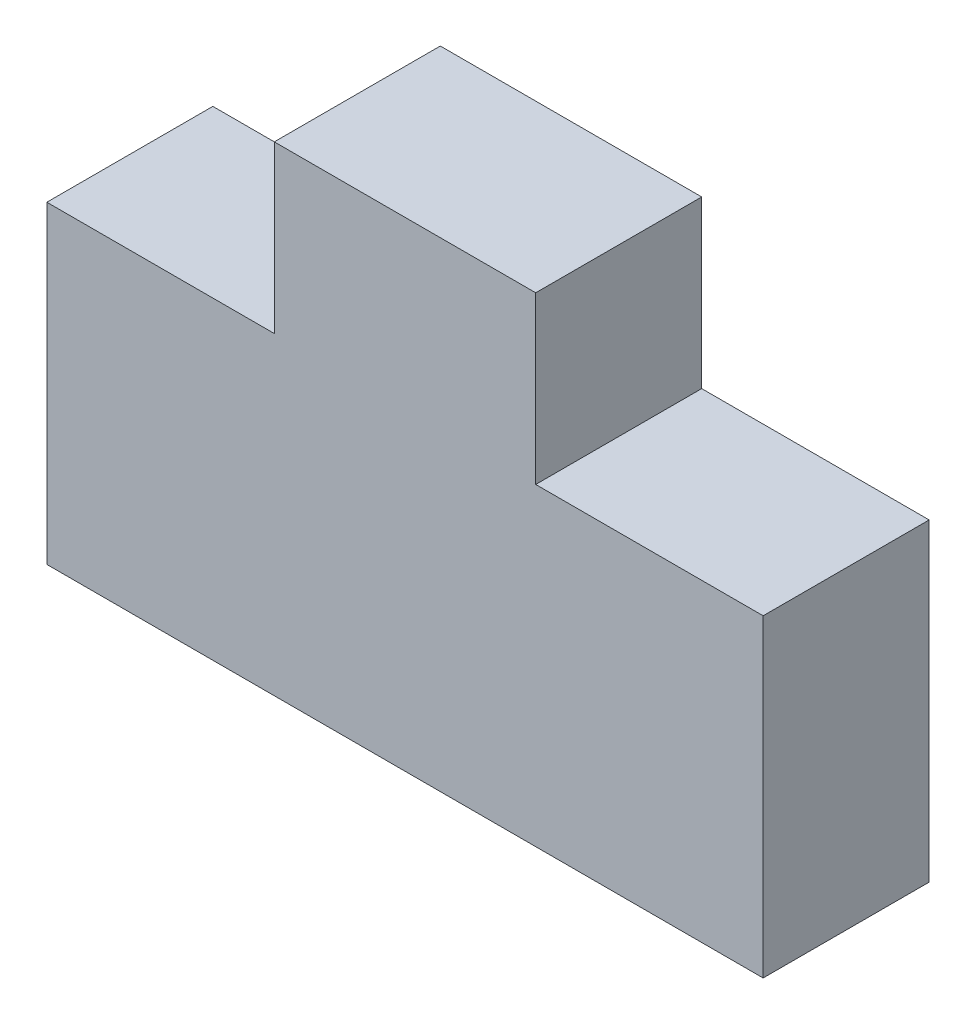
ISO-10303-21;
HEADER;
FILE_DESCRIPTION(('STEP AP214'),'2;1');
FILE_NAME('part.step','',(''),(''),'','','');
FILE_SCHEMA(('AUTOMOTIVE_DESIGN { 1 0 10303 214 1 1 1 1 }'));
ENDSEC;
DATA;
#1=APPLICATION_CONTEXT('core data for automotive mechanical design processes');
#2=APPLICATION_PROTOCOL_DEFINITION('international standard','automotive_design',2000,#1);
#3=PRODUCT_CONTEXT('',#1,'mechanical');
#4=PRODUCT('Part','Part','',(#3));
#5=PRODUCT_RELATED_PRODUCT_CATEGORY('part','',(#4));
#6=PRODUCT_DEFINITION_FORMATION('','',#4);
#7=PRODUCT_DEFINITION_CONTEXT('part definition',#1,'design');
#8=PRODUCT_DEFINITION('design','',#6,#7);
#9=PRODUCT_DEFINITION_SHAPE('','',#8);
#10=(LENGTH_UNIT() NAMED_UNIT(*) SI_UNIT(.MILLI.,.METRE.));
#11=(NAMED_UNIT(*) PLANE_ANGLE_UNIT() SI_UNIT($,.RADIAN.));
#12=(NAMED_UNIT(*) SI_UNIT($,.STERADIAN.) SOLID_ANGLE_UNIT());
#13=UNCERTAINTY_MEASURE_WITH_UNIT(LENGTH_MEASURE(1.E-05),#10,'distance_accuracy_value','');
#14=(GEOMETRIC_REPRESENTATION_CONTEXT(3) GLOBAL_UNCERTAINTY_ASSIGNED_CONTEXT((#13)) GLOBAL_UNIT_ASSIGNED_CONTEXT((#10,
#11,#12)) REPRESENTATION_CONTEXT('',''));
#15=CARTESIAN_POINT('',(0.,0.,0.));
#16=DIRECTION('',(0.,0.,1.));
#17=DIRECTION('',(1.,0.,0.));
#18=AXIS2_PLACEMENT_3D('',#15,#16,#17);
#19=CARTESIAN_POINT('',(0.,12.,0.));
#20=DIRECTION('',(0.,-1.,0.));
#21=DIRECTION('',(0.,0.,-1.));
#22=AXIS2_PLACEMENT_3D('',#19,#20,#21);
#23=PLANE('',#22);
#24=DIRECTION('',(0.,0.,1.));
#25=VECTOR('',#24,1.);
#26=CARTESIAN_POINT('',(8.7,12.,-6.35));
#27=LINE('',#26,#25);
#28=CARTESIAN_POINT('',(8.7,12.,-6.35));
#29=VERTEX_POINT('',#28);
#30=CARTESIAN_POINT('',(8.7,12.,0.));
#31=VERTEX_POINT('',#30);
#32=EDGE_CURVE('E111',#29,#31,#27,.T.);
#33=ORIENTED_EDGE('',*,*,#32,.F.);
#34=DIRECTION('',(-1.,0.,0.));
#35=VECTOR('',#34,1.);
#36=CARTESIAN_POINT('',(0.,12.,-6.35));
#37=LINE('',#36,#35);
#38=CARTESIAN_POINT('',(0.,12.,-6.35));
#39=VERTEX_POINT('',#38);
#40=EDGE_CURVE('E57',#29,#39,#37,.T.);
#41=ORIENTED_EDGE('',*,*,#40,.T.);
#42=DIRECTION('',(0.,0.,1.));
#43=VECTOR('',#42,1.);
#44=CARTESIAN_POINT('',(0.,12.,0.));
#45=LINE('',#44,#43);
#46=CARTESIAN_POINT('',(0.,12.,0.));
#47=VERTEX_POINT('',#46);
#48=EDGE_CURVE('E139',#39,#47,#45,.T.);
#49=ORIENTED_EDGE('',*,*,#48,.T.);
#50=DIRECTION('',(1.,0.,0.));
#51=VECTOR('',#50,1.);
#52=CARTESIAN_POINT('',(0.,12.,0.));
#53=LINE('',#52,#51);
#54=EDGE_CURVE('E86',#47,#31,#53,.T.);
#55=ORIENTED_EDGE('',*,*,#54,.T.);
#56=EDGE_LOOP('',(#33,#41,#49,#55));
#57=FACE_BOUND('',#56,.T.);
#58=ADVANCED_FACE('F33',(#57),#23,.F.);
#59=CARTESIAN_POINT('',(0.,12.,0.));
#60=DIRECTION('',(1.,0.,0.));
#61=DIRECTION('',(0.,0.,-1.));
#62=AXIS2_PLACEMENT_3D('',#59,#60,#61);
#63=PLANE('',#62);
#64=DIRECTION('',(0.,0.,1.));
#65=VECTOR('',#64,1.);
#66=CARTESIAN_POINT('',(0.,0.,0.));
#67=LINE('',#66,#65);
#68=CARTESIAN_POINT('',(0.,0.,-6.35));
#69=VERTEX_POINT('',#68);
#70=CARTESIAN_POINT('',(0.,0.,0.));
#71=VERTEX_POINT('',#70);
#72=EDGE_CURVE('E131',#69,#71,#67,.T.);
#73=ORIENTED_EDGE('',*,*,#72,.T.);
#74=DIRECTION('',(0.,-1.,0.));
#75=VECTOR('',#74,1.);
#76=CARTESIAN_POINT('',(0.,12.,0.));
#77=LINE('',#76,#75);
#78=EDGE_CURVE('E11',#47,#71,#77,.T.);
#79=ORIENTED_EDGE('',*,*,#78,.F.);
#80=ORIENTED_EDGE('',*,*,#48,.F.);
#81=DIRECTION('',(0.,-1.,0.));
#82=VECTOR('',#81,1.);
#83=CARTESIAN_POINT('',(0.,12.,-6.35));
#84=LINE('',#83,#82);
#85=EDGE_CURVE('E122',#39,#69,#84,.T.);
#86=ORIENTED_EDGE('',*,*,#85,.T.);
#87=EDGE_LOOP('',(#73,#79,#80,#86));
#88=FACE_BOUND('',#87,.T.);
#89=ADVANCED_FACE('F35',(#88),#63,.F.);
#90=CARTESIAN_POINT('',(0.,12.,0.));
#91=DIRECTION('',(0.,0.,-1.));
#92=DIRECTION('',(-1.,0.,0.));
#93=AXIS2_PLACEMENT_3D('',#90,#91,#92);
#94=PLANE('',#93);
#95=DIRECTION('',(1.,0.,0.));
#96=VECTOR('',#95,1.);
#97=CARTESIAN_POINT('',(0.,0.,0.));
#98=LINE('',#97,#96);
#99=CARTESIAN_POINT('',(27.4,0.,0.));
#100=VERTEX_POINT('',#99);
#101=EDGE_CURVE('E134',#71,#100,#98,.T.);
#102=ORIENTED_EDGE('',*,*,#101,.T.);
#103=DIRECTION('',(0.,-1.,0.));
#104=VECTOR('',#103,1.);
#105=CARTESIAN_POINT('',(27.4,12.,0.));
#106=LINE('',#105,#104);
#107=CARTESIAN_POINT('',(27.4,12.,0.));
#108=VERTEX_POINT('',#107);
#109=EDGE_CURVE('E41',#108,#100,#106,.T.);
#110=ORIENTED_EDGE('',*,*,#109,.F.);
#111=CARTESIAN_POINT('',(18.7,12.,0.));
#112=VERTEX_POINT('',#111);
#113=EDGE_CURVE('E155',#112,#108,#53,.T.);
#114=ORIENTED_EDGE('',*,*,#113,.F.);
#115=DIRECTION('',(0.,1.,0.));
#116=VECTOR('',#115,1.);
#117=CARTESIAN_POINT('',(18.7,12.,0.));
#118=LINE('',#117,#116);
#119=CARTESIAN_POINT('',(18.7,18.35,0.));
#120=VERTEX_POINT('',#119);
#121=EDGE_CURVE('E48',#112,#120,#118,.T.);
#122=ORIENTED_EDGE('',*,*,#121,.T.);
#123=DIRECTION('',(-1.,0.,0.));
#124=VECTOR('',#123,1.);
#125=CARTESIAN_POINT('',(8.7,18.35,0.));
#126=LINE('',#125,#124);
#127=CARTESIAN_POINT('',(8.7,18.35,0.));
#128=VERTEX_POINT('',#127);
#129=EDGE_CURVE('E116',#120,#128,#126,.T.);
#130=ORIENTED_EDGE('',*,*,#129,.T.);
#131=DIRECTION('',(0.,-1.,0.));
#132=VECTOR('',#131,1.);
#133=CARTESIAN_POINT('',(8.7,12.,0.));
#134=LINE('',#133,#132);
#135=EDGE_CURVE('E165',#128,#31,#134,.T.);
#136=ORIENTED_EDGE('',*,*,#135,.T.);
#137=ORIENTED_EDGE('',*,*,#54,.F.);
#138=ORIENTED_EDGE('',*,*,#78,.T.);
#139=EDGE_LOOP('',(#102,#110,#114,#122,#130,#136,#137,#138));
#140=FACE_BOUND('',#139,.T.);
#141=ADVANCED_FACE('F175',(#140),#94,.F.);
#142=CARTESIAN_POINT('',(27.4,12.,0.));
#143=DIRECTION('',(-1.,0.,0.));
#144=DIRECTION('',(0.,0.,1.));
#145=AXIS2_PLACEMENT_3D('',#142,#143,#144);
#146=PLANE('',#145);
#147=DIRECTION('',(0.,0.,-1.));
#148=VECTOR('',#147,1.);
#149=CARTESIAN_POINT('',(27.4,0.,0.));
#150=LINE('',#149,#148);
#151=CARTESIAN_POINT('',(27.4,0.,-6.35));
#152=VERTEX_POINT('',#151);
#153=EDGE_CURVE('E136',#100,#152,#150,.T.);
#154=ORIENTED_EDGE('',*,*,#153,.T.);
#155=DIRECTION('',(0.,-1.,0.));
#156=VECTOR('',#155,1.);
#157=CARTESIAN_POINT('',(27.4,12.,-6.35));
#158=LINE('',#157,#156);
#159=CARTESIAN_POINT('',(27.4,12.,-6.35));
#160=VERTEX_POINT('',#159);
#161=EDGE_CURVE('E141',#160,#152,#158,.T.);
#162=ORIENTED_EDGE('',*,*,#161,.F.);
#163=DIRECTION('',(0.,0.,-1.));
#164=VECTOR('',#163,1.);
#165=CARTESIAN_POINT('',(27.4,12.,0.));
#166=LINE('',#165,#164);
#167=EDGE_CURVE('E125',#108,#160,#166,.T.);
#168=ORIENTED_EDGE('',*,*,#167,.F.);
#169=ORIENTED_EDGE('',*,*,#109,.T.);
#170=EDGE_LOOP('',(#154,#162,#168,#169));
#171=FACE_BOUND('',#170,.T.);
#172=ADVANCED_FACE('F147',(#171),#146,.F.);
#173=CARTESIAN_POINT('',(0.,12.,-6.35));
#174=DIRECTION('',(0.,0.,1.));
#175=DIRECTION('',(1.,0.,0.));
#176=AXIS2_PLACEMENT_3D('',#173,#174,#175);
#177=PLANE('',#176);
#178=DIRECTION('',(-1.,0.,0.));
#179=VECTOR('',#178,1.);
#180=CARTESIAN_POINT('',(0.,0.,-6.35));
#181=LINE('',#180,#179);
#182=EDGE_CURVE('E79',#152,#69,#181,.T.);
#183=ORIENTED_EDGE('',*,*,#182,.T.);
#184=ORIENTED_EDGE('',*,*,#85,.F.);
#185=ORIENTED_EDGE('',*,*,#40,.F.);
#186=DIRECTION('',(0.,-1.,0.));
#187=VECTOR('',#186,1.);
#188=CARTESIAN_POINT('',(8.7,12.,-6.35));
#189=LINE('',#188,#187);
#190=CARTESIAN_POINT('',(8.7,18.35,-6.35));
#191=VERTEX_POINT('',#190);
#192=EDGE_CURVE('E108',#191,#29,#189,.T.);
#193=ORIENTED_EDGE('',*,*,#192,.F.);
#194=DIRECTION('',(-1.,0.,0.));
#195=VECTOR('',#194,1.);
#196=CARTESIAN_POINT('',(8.7,18.35,-6.35));
#197=LINE('',#196,#195);
#198=CARTESIAN_POINT('',(18.7,18.35,-6.35));
#199=VERTEX_POINT('',#198);
#200=EDGE_CURVE('E119',#199,#191,#197,.T.);
#201=ORIENTED_EDGE('',*,*,#200,.F.);
#202=DIRECTION('',(0.,1.,0.));
#203=VECTOR('',#202,1.);
#204=CARTESIAN_POINT('',(18.7,12.,-6.35));
#205=LINE('',#204,#203);
#206=CARTESIAN_POINT('',(18.7,12.,-6.35));
#207=VERTEX_POINT('',#206);
#208=EDGE_CURVE('E115',#207,#199,#205,.T.);
#209=ORIENTED_EDGE('',*,*,#208,.F.);
#210=EDGE_CURVE('E124',#160,#207,#37,.T.);
#211=ORIENTED_EDGE('',*,*,#210,.F.);
#212=ORIENTED_EDGE('',*,*,#161,.T.);
#213=EDGE_LOOP('',(#183,#184,#185,#193,#201,#209,#211,#212));
#214=FACE_BOUND('',#213,.T.);
#215=ADVANCED_FACE('F121',(#214),#177,.F.);
#216=ORIENTED_EDGE('',*,*,#210,.T.);
#217=DIRECTION('',(0.,0.,1.));
#218=VECTOR('',#217,1.);
#219=CARTESIAN_POINT('',(18.7,12.,-6.35));
#220=LINE('',#219,#218);
#221=EDGE_CURVE('E118',#207,#112,#220,.T.);
#222=ORIENTED_EDGE('',*,*,#221,.T.);
#223=ORIENTED_EDGE('',*,*,#113,.T.);
#224=ORIENTED_EDGE('',*,*,#167,.T.);
#225=EDGE_LOOP('',(#216,#222,#223,#224));
#226=FACE_BOUND('',#225,.T.);
#227=ADVANCED_FACE('F177',(#226),#23,.F.);
#228=CARTESIAN_POINT('',(0.,0.,0.));
#229=DIRECTION('',(0.,-1.,0.));
#230=DIRECTION('',(0.,0.,-1.));
#231=AXIS2_PLACEMENT_3D('',#228,#229,#230);
#232=PLANE('',#231);
#233=ORIENTED_EDGE('',*,*,#72,.F.);
#234=ORIENTED_EDGE('',*,*,#182,.F.);
#235=ORIENTED_EDGE('',*,*,#153,.F.);
#236=ORIENTED_EDGE('',*,*,#101,.F.);
#237=EDGE_LOOP('',(#233,#234,#235,#236));
#238=FACE_BOUND('',#237,.T.);
#239=ADVANCED_FACE('F152',(#238),#232,.T.);
#240=CARTESIAN_POINT('',(8.7,12.,-6.35));
#241=DIRECTION('',(-1.,0.,0.));
#242=DIRECTION('',(0.,0.,1.));
#243=AXIS2_PLACEMENT_3D('',#240,#241,#242);
#244=PLANE('',#243);
#245=ORIENTED_EDGE('',*,*,#135,.F.);
#246=DIRECTION('',(0.,0.,1.));
#247=VECTOR('',#246,1.);
#248=CARTESIAN_POINT('',(8.7,18.35,-6.35));
#249=LINE('',#248,#247);
#250=EDGE_CURVE('E112',#191,#128,#249,.T.);
#251=ORIENTED_EDGE('',*,*,#250,.F.);
#252=ORIENTED_EDGE('',*,*,#192,.T.);
#253=ORIENTED_EDGE('',*,*,#32,.T.);
#254=EDGE_LOOP('',(#245,#251,#252,#253));
#255=FACE_BOUND('',#254,.T.);
#256=ADVANCED_FACE('F110',(#255),#244,.T.);
#257=CARTESIAN_POINT('',(8.7,18.35,-6.35));
#258=DIRECTION('',(0.,1.,0.));
#259=DIRECTION('',(0.,0.,1.));
#260=AXIS2_PLACEMENT_3D('',#257,#258,#259);
#261=PLANE('',#260);
#262=ORIENTED_EDGE('',*,*,#129,.F.);
#263=DIRECTION('',(0.,0.,1.));
#264=VECTOR('',#263,1.);
#265=CARTESIAN_POINT('',(18.7,18.35,-6.35));
#266=LINE('',#265,#264);
#267=EDGE_CURVE('E159',#199,#120,#266,.T.);
#268=ORIENTED_EDGE('',*,*,#267,.F.);
#269=ORIENTED_EDGE('',*,*,#200,.T.);
#270=ORIENTED_EDGE('',*,*,#250,.T.);
#271=EDGE_LOOP('',(#262,#268,#269,#270));
#272=FACE_BOUND('',#271,.T.);
#273=ADVANCED_FACE('F174',(#272),#261,.T.);
#274=CARTESIAN_POINT('',(18.7,12.,-6.35));
#275=DIRECTION('',(1.,0.,0.));
#276=DIRECTION('',(0.,0.,-1.));
#277=AXIS2_PLACEMENT_3D('',#274,#275,#276);
#278=PLANE('',#277);
#279=ORIENTED_EDGE('',*,*,#121,.F.);
#280=ORIENTED_EDGE('',*,*,#221,.F.);
#281=ORIENTED_EDGE('',*,*,#208,.T.);
#282=ORIENTED_EDGE('',*,*,#267,.T.);
#283=EDGE_LOOP('',(#279,#280,#281,#282));
#284=FACE_BOUND('',#283,.T.);
#285=ADVANCED_FACE('F170',(#284),#278,.T.);
#286=CLOSED_SHELL('',(#58,#89,#141,#172,#215,#227,#239,#256,#273,#285));
#287=MANIFOLD_SOLID_BREP('B2',#286);
#288=ADVANCED_BREP_SHAPE_REPRESENTATION('',(#18,#287),#14);
#289=SHAPE_DEFINITION_REPRESENTATION(#9,#288);
ENDSEC;
END-ISO-10303-21;
